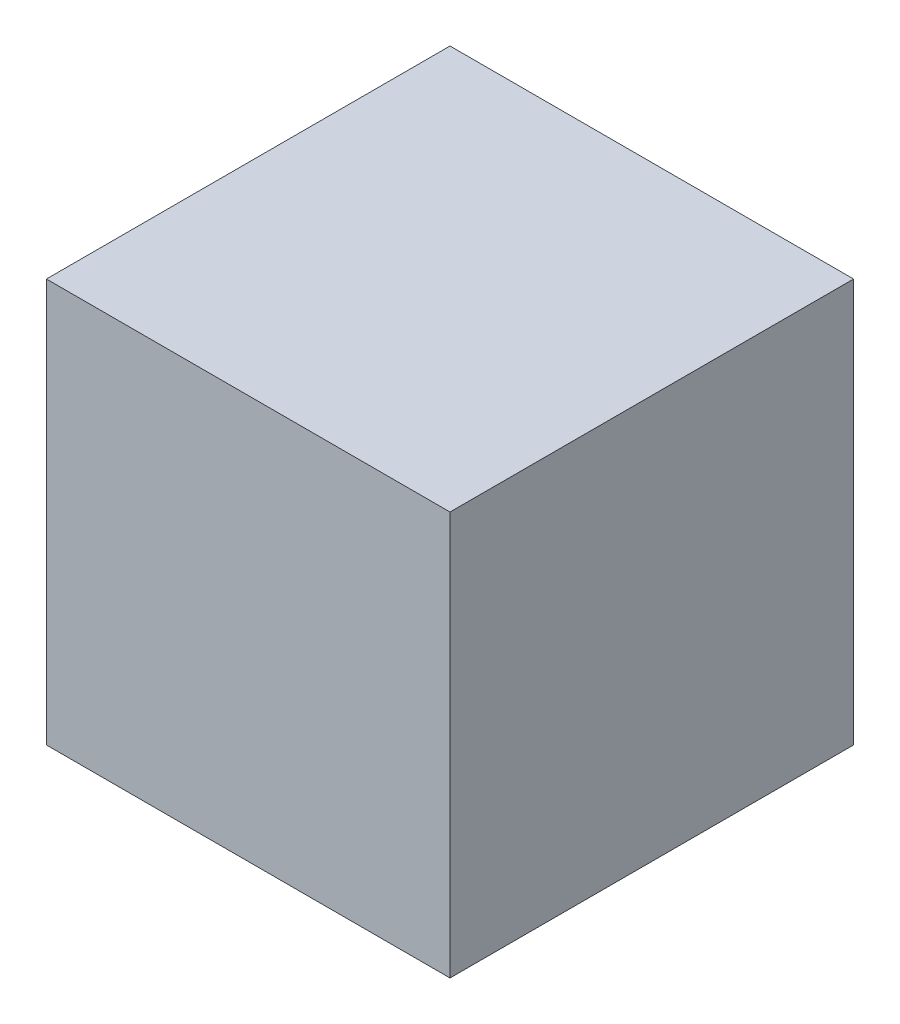
ISO-10303-21;
HEADER;
FILE_DESCRIPTION(('STEP AP214'),'2;1');
FILE_NAME('part.step','',(''),(''),'','','');
FILE_SCHEMA(('AUTOMOTIVE_DESIGN { 1 0 10303 214 1 1 1 1 }'));
ENDSEC;
DATA;
#1=APPLICATION_CONTEXT('core data for automotive mechanical design processes');
#2=APPLICATION_PROTOCOL_DEFINITION('international standard','automotive_design',2000,#1);
#3=PRODUCT_CONTEXT('',#1,'mechanical');
#4=PRODUCT('Part','Part','',(#3));
#5=PRODUCT_RELATED_PRODUCT_CATEGORY('part','',(#4));
#6=PRODUCT_DEFINITION_FORMATION('','',#4);
#7=PRODUCT_DEFINITION_CONTEXT('part definition',#1,'design');
#8=PRODUCT_DEFINITION('design','',#6,#7);
#9=PRODUCT_DEFINITION_SHAPE('','',#8);
#10=(LENGTH_UNIT() NAMED_UNIT(*) SI_UNIT(.MILLI.,.METRE.));
#11=(NAMED_UNIT(*) PLANE_ANGLE_UNIT() SI_UNIT($,.RADIAN.));
#12=(NAMED_UNIT(*) SI_UNIT($,.STERADIAN.) SOLID_ANGLE_UNIT());
#13=UNCERTAINTY_MEASURE_WITH_UNIT(LENGTH_MEASURE(1.E-05),#10,'distance_accuracy_value','');
#14=(GEOMETRIC_REPRESENTATION_CONTEXT(3) GLOBAL_UNCERTAINTY_ASSIGNED_CONTEXT((#13)) GLOBAL_UNIT_ASSIGNED_CONTEXT((#10,
#11,#12)) REPRESENTATION_CONTEXT('',''));
#15=CARTESIAN_POINT('',(0.,0.,0.));
#16=DIRECTION('',(0.,0.,1.));
#17=DIRECTION('',(1.,0.,0.));
#18=AXIS2_PLACEMENT_3D('',#15,#16,#17);
#19=CARTESIAN_POINT('',(25.4,50.8,25.4));
#20=DIRECTION('',(-1.,0.,0.));
#21=DIRECTION('',(0.,0.,1.));
#22=AXIS2_PLACEMENT_3D('',#19,#20,#21);
#23=PLANE('',#22);
#24=DIRECTION('',(0.,0.,-1.));
#25=VECTOR('',#24,1.);
#26=CARTESIAN_POINT('',(25.4,0.,25.4));
#27=LINE('',#26,#25);
#28=CARTESIAN_POINT('',(25.4,0.,25.4));
#29=VERTEX_POINT('',#28);
#30=CARTESIAN_POINT('',(25.4,0.,-25.4));
#31=VERTEX_POINT('',#30);
#32=EDGE_CURVE('E96',#29,#31,#27,.T.);
#33=ORIENTED_EDGE('',*,*,#32,.T.);
#34=DIRECTION('',(0.,-1.,0.));
#35=VECTOR('',#34,1.);
#36=CARTESIAN_POINT('',(25.4,50.8,-25.4));
#37=LINE('',#36,#35);
#38=CARTESIAN_POINT('',(25.4,50.8,-25.4));
#39=VERTEX_POINT('',#38);
#40=EDGE_CURVE('E11',#39,#31,#37,.T.);
#41=ORIENTED_EDGE('',*,*,#40,.F.);
#42=DIRECTION('',(0.,0.,-1.));
#43=VECTOR('',#42,1.);
#44=CARTESIAN_POINT('',(25.4,50.8,25.4));
#45=LINE('',#44,#43);
#46=CARTESIAN_POINT('',(25.4,50.8,25.4));
#47=VERTEX_POINT('',#46);
#48=EDGE_CURVE('E84',#47,#39,#45,.T.);
#49=ORIENTED_EDGE('',*,*,#48,.F.);
#50=DIRECTION('',(0.,-1.,0.));
#51=VECTOR('',#50,1.);
#52=CARTESIAN_POINT('',(25.4,50.8,25.4));
#53=LINE('',#52,#51);
#54=EDGE_CURVE('E92',#47,#29,#53,.T.);
#55=ORIENTED_EDGE('',*,*,#54,.T.);
#56=EDGE_LOOP('',(#33,#41,#49,#55));
#57=FACE_BOUND('',#56,.T.);
#58=ADVANCED_FACE('F33',(#57),#23,.F.);
#59=CARTESIAN_POINT('',(-25.4,50.8,-25.4));
#60=DIRECTION('',(0.,0.,1.));
#61=DIRECTION('',(1.,0.,0.));
#62=AXIS2_PLACEMENT_3D('',#59,#60,#61);
#63=PLANE('',#62);
#64=DIRECTION('',(-1.,0.,0.));
#65=VECTOR('',#64,1.);
#66=CARTESIAN_POINT('',(-25.4,0.,-25.4));
#67=LINE('',#66,#65);
#68=CARTESIAN_POINT('',(-25.4,0.,-25.4));
#69=VERTEX_POINT('',#68);
#70=EDGE_CURVE('E88',#31,#69,#67,.T.);
#71=ORIENTED_EDGE('',*,*,#70,.T.);
#72=DIRECTION('',(0.,-1.,0.));
#73=VECTOR('',#72,1.);
#74=CARTESIAN_POINT('',(-25.4,50.8,-25.4));
#75=LINE('',#74,#73);
#76=CARTESIAN_POINT('',(-25.4,50.8,-25.4));
#77=VERTEX_POINT('',#76);
#78=EDGE_CURVE('E41',#77,#69,#75,.T.);
#79=ORIENTED_EDGE('',*,*,#78,.F.);
#80=DIRECTION('',(-1.,0.,0.));
#81=VECTOR('',#80,1.);
#82=CARTESIAN_POINT('',(-25.4,50.8,-25.4));
#83=LINE('',#82,#81);
#84=EDGE_CURVE('E79',#39,#77,#83,.T.);
#85=ORIENTED_EDGE('',*,*,#84,.F.);
#86=ORIENTED_EDGE('',*,*,#40,.T.);
#87=EDGE_LOOP('',(#71,#79,#85,#86));
#88=FACE_BOUND('',#87,.T.);
#89=ADVANCED_FACE('F87',(#88),#63,.F.);
#90=CARTESIAN_POINT('',(-25.4,50.8,25.4));
#91=DIRECTION('',(1.,0.,0.));
#92=DIRECTION('',(0.,0.,-1.));
#93=AXIS2_PLACEMENT_3D('',#90,#91,#92);
#94=PLANE('',#93);
#95=DIRECTION('',(0.,0.,1.));
#96=VECTOR('',#95,1.);
#97=CARTESIAN_POINT('',(-25.4,0.,25.4));
#98=LINE('',#97,#96);
#99=CARTESIAN_POINT('',(-25.4,0.,25.4));
#100=VERTEX_POINT('',#99);
#101=EDGE_CURVE('E66',#69,#100,#98,.T.);
#102=ORIENTED_EDGE('',*,*,#101,.T.);
#103=DIRECTION('',(0.,-1.,0.));
#104=VECTOR('',#103,1.);
#105=CARTESIAN_POINT('',(-25.4,50.8,25.4));
#106=LINE('',#105,#104);
#107=CARTESIAN_POINT('',(-25.4,50.8,25.4));
#108=VERTEX_POINT('',#107);
#109=EDGE_CURVE('E89',#108,#100,#106,.T.);
#110=ORIENTED_EDGE('',*,*,#109,.F.);
#111=DIRECTION('',(0.,0.,1.));
#112=VECTOR('',#111,1.);
#113=CARTESIAN_POINT('',(-25.4,50.8,25.4));
#114=LINE('',#113,#112);
#115=EDGE_CURVE('E82',#77,#108,#114,.T.);
#116=ORIENTED_EDGE('',*,*,#115,.F.);
#117=ORIENTED_EDGE('',*,*,#78,.T.);
#118=EDGE_LOOP('',(#102,#110,#116,#117));
#119=FACE_BOUND('',#118,.T.);
#120=ADVANCED_FACE('F90',(#119),#94,.F.);
#121=CARTESIAN_POINT('',(-25.4,50.8,25.4));
#122=DIRECTION('',(0.,0.,-1.));
#123=DIRECTION('',(-1.,0.,0.));
#124=AXIS2_PLACEMENT_3D('',#121,#122,#123);
#125=PLANE('',#124);
#126=DIRECTION('',(1.,0.,0.));
#127=VECTOR('',#126,1.);
#128=CARTESIAN_POINT('',(-25.4,0.,25.4));
#129=LINE('',#128,#127);
#130=EDGE_CURVE('E72',#100,#29,#129,.T.);
#131=ORIENTED_EDGE('',*,*,#130,.T.);
#132=ORIENTED_EDGE('',*,*,#54,.F.);
#133=DIRECTION('',(1.,0.,0.));
#134=VECTOR('',#133,1.);
#135=CARTESIAN_POINT('',(-25.4,50.8,25.4));
#136=LINE('',#135,#134);
#137=EDGE_CURVE('E49',#108,#47,#136,.T.);
#138=ORIENTED_EDGE('',*,*,#137,.F.);
#139=ORIENTED_EDGE('',*,*,#109,.T.);
#140=EDGE_LOOP('',(#131,#132,#138,#139));
#141=FACE_BOUND('',#140,.T.);
#142=ADVANCED_FACE('F103',(#141),#125,.F.);
#143=CARTESIAN_POINT('',(0.,50.8,0.));
#144=DIRECTION('',(0.,-1.,0.));
#145=DIRECTION('',(0.,0.,-1.));
#146=AXIS2_PLACEMENT_3D('',#143,#144,#145);
#147=PLANE('',#146);
#148=ORIENTED_EDGE('',*,*,#48,.T.);
#149=ORIENTED_EDGE('',*,*,#84,.T.);
#150=ORIENTED_EDGE('',*,*,#115,.T.);
#151=ORIENTED_EDGE('',*,*,#137,.T.);
#152=EDGE_LOOP('',(#148,#149,#150,#151));
#153=FACE_BOUND('',#152,.T.);
#154=ADVANCED_FACE('F80',(#153),#147,.F.);
#155=CARTESIAN_POINT('',(0.,0.,0.));
#156=DIRECTION('',(0.,-1.,0.));
#157=DIRECTION('',(0.,0.,-1.));
#158=AXIS2_PLACEMENT_3D('',#155,#156,#157);
#159=PLANE('',#158);
#160=ORIENTED_EDGE('',*,*,#32,.F.);
#161=ORIENTED_EDGE('',*,*,#130,.F.);
#162=ORIENTED_EDGE('',*,*,#101,.F.);
#163=ORIENTED_EDGE('',*,*,#70,.F.);
#164=EDGE_LOOP('',(#160,#161,#162,#163));
#165=FACE_BOUND('',#164,.T.);
#166=ADVANCED_FACE('F106',(#165),#159,.T.);
#167=CLOSED_SHELL('',(#58,#89,#120,#142,#154,#166));
#168=MANIFOLD_SOLID_BREP('B2',#167);
#169=ADVANCED_BREP_SHAPE_REPRESENTATION('',(#18,#168),#14);
#170=SHAPE_DEFINITION_REPRESENTATION(#9,#169);
ENDSEC;
END-ISO-10303-21;
